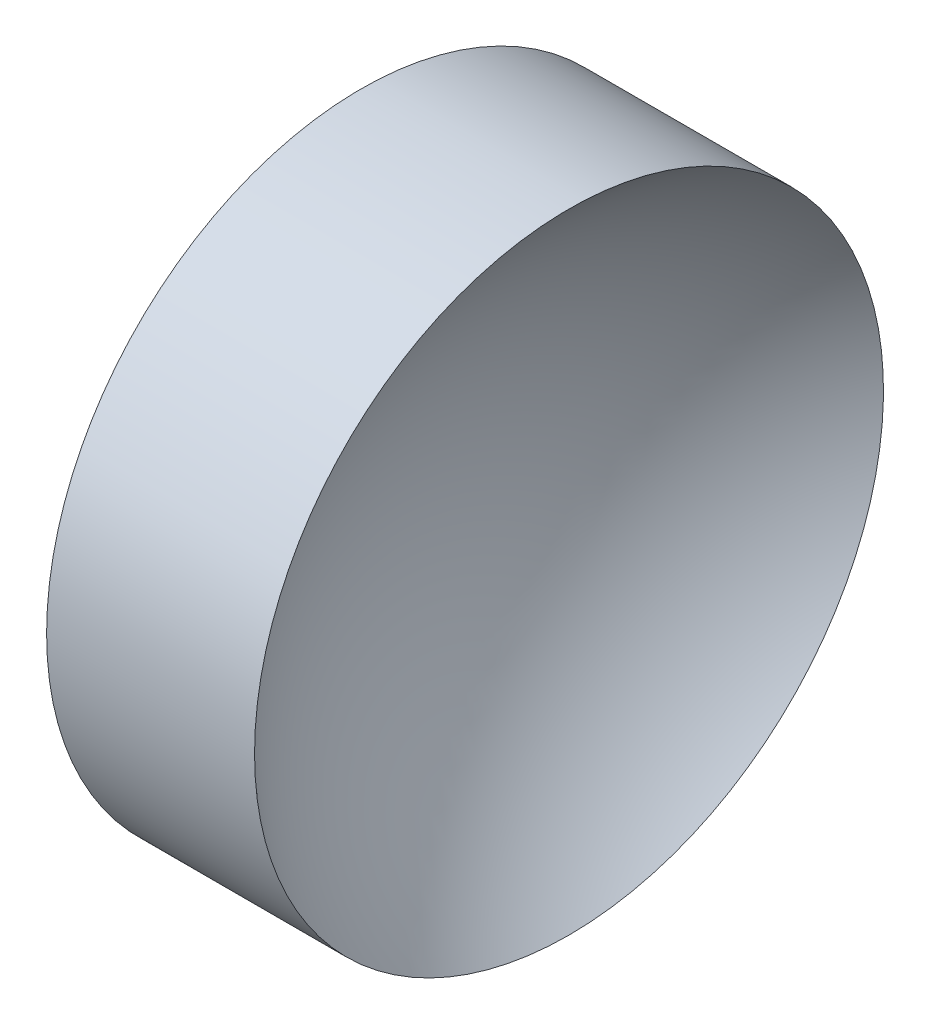
ISO-10303-21;
HEADER;
FILE_DESCRIPTION(('STEP AP214'),'2;1');
FILE_NAME('part.step','',(''),(''),'','','');
FILE_SCHEMA(('AUTOMOTIVE_DESIGN { 1 0 10303 214 1 1 1 1 }'));
ENDSEC;
DATA;
#1=APPLICATION_CONTEXT('core data for automotive mechanical design processes');
#2=APPLICATION_PROTOCOL_DEFINITION('international standard','automotive_design',2000,#1);
#3=PRODUCT_CONTEXT('',#1,'mechanical');
#4=PRODUCT('Part','Part','',(#3));
#5=PRODUCT_RELATED_PRODUCT_CATEGORY('part','',(#4));
#6=PRODUCT_DEFINITION_FORMATION('','',#4);
#7=PRODUCT_DEFINITION_CONTEXT('part definition',#1,'design');
#8=PRODUCT_DEFINITION('design','',#6,#7);
#9=PRODUCT_DEFINITION_SHAPE('','',#8);
#10=(LENGTH_UNIT() NAMED_UNIT(*) SI_UNIT(.MILLI.,.METRE.));
#11=(NAMED_UNIT(*) PLANE_ANGLE_UNIT() SI_UNIT($,.RADIAN.));
#12=(NAMED_UNIT(*) SI_UNIT($,.STERADIAN.) SOLID_ANGLE_UNIT());
#13=UNCERTAINTY_MEASURE_WITH_UNIT(LENGTH_MEASURE(1.E-05),#10,'distance_accuracy_value','');
#14=(GEOMETRIC_REPRESENTATION_CONTEXT(3) GLOBAL_UNCERTAINTY_ASSIGNED_CONTEXT((#13)) GLOBAL_UNIT_ASSIGNED_CONTEXT((#10,
#11,#12)) REPRESENTATION_CONTEXT('',''));
#15=CARTESIAN_POINT('',(0.,0.,0.));
#16=DIRECTION('',(0.,0.,1.));
#17=DIRECTION('',(1.,0.,0.));
#18=AXIS2_PLACEMENT_3D('',#15,#16,#17);
#19=CARTESIAN_POINT('',(56.1574244609644,26.089041149195,0.));
#20=DIRECTION('',(-1.,0.,0.));
#21=DIRECTION('',(0.,-1.,0.));
#22=AXIS2_PLACEMENT_3D('',#19,#20,#21);
#23=SPHERICAL_SURFACE('',#22,10.33827176781);
#24=CARTESIAN_POINT('',(49.6091526931544,26.089041149195,0.));
#25=DIRECTION('',(-1.,0.,0.));
#26=DIRECTION('',(0.,0.,1.));
#27=AXIS2_PLACEMENT_3D('',#24,#25,#26);
#28=CIRCLE('',#27,8.);
#29=CARTESIAN_POINT('',(49.6091526931544,26.089041149195,8.));
#30=VERTEX_POINT('',#29);
#31=EDGE_CURVE('E10',#30,#30,#28,.T.);
#32=ORIENTED_EDGE('',*,*,#31,.F.);
#33=EDGE_LOOP('',(#32));
#34=FACE_BOUND('',#33,.T.);
#35=ADVANCED_FACE('F35',(#34),#23,.F.);
#36=CARTESIAN_POINT('',(42.4498611141368,26.089041149195,0.));
#37=DIRECTION('',(-1.,0.,0.));
#38=DIRECTION('',(0.,0.,1.));
#39=AXIS2_PLACEMENT_3D('',#36,#37,#38);
#40=CYLINDRICAL_SURFACE('',#39,8.);
#41=CARTESIAN_POINT('',(44.3191526931544,26.089041149195,0.));
#42=DIRECTION('',(-1.,0.,0.));
#43=DIRECTION('',(0.,0.,1.));
#44=AXIS2_PLACEMENT_3D('',#41,#42,#43);
#45=CIRCLE('',#44,8.);
#46=CARTESIAN_POINT('',(44.3191526931544,26.089041149195,8.));
#47=VERTEX_POINT('',#46);
#48=EDGE_CURVE('E41',#47,#47,#45,.T.);
#49=ORIENTED_EDGE('',*,*,#48,.F.);
#50=EDGE_LOOP('',(#49));
#51=FACE_BOUND('',#50,.T.);
#52=ORIENTED_EDGE('',*,*,#31,.T.);
#53=EDGE_LOOP('',(#52));
#54=FACE_BOUND('',#53,.T.);
#55=ADVANCED_FACE('F49',(#51,#54),#40,.T.);
#56=CARTESIAN_POINT('',(44.3191526931544,26.089041149195,0.));
#57=DIRECTION('',(1.,0.,0.));
#58=DIRECTION('',(0.,0.,-1.));
#59=AXIS2_PLACEMENT_3D('',#56,#57,#58);
#60=PLANE('',#59);
#61=ORIENTED_EDGE('',*,*,#48,.T.);
#62=EDGE_LOOP('',(#61));
#63=FACE_BOUND('',#62,.T.);
#64=ADVANCED_FACE('F47',(#63),#60,.F.);
#65=CLOSED_SHELL('',(#35,#55,#64));
#66=MANIFOLD_SOLID_BREP('B2',#65);
#67=ADVANCED_BREP_SHAPE_REPRESENTATION('',(#18,#66),#14);
#68=SHAPE_DEFINITION_REPRESENTATION(#9,#67);
ENDSEC;
END-ISO-10303-21;
